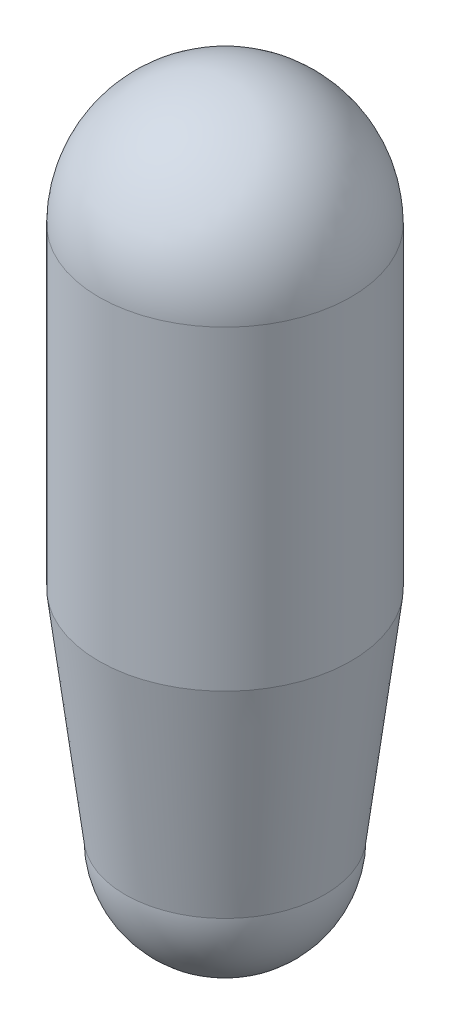
ISO-10303-21;
HEADER;
FILE_DESCRIPTION(('STEP AP214'),'2;1');
FILE_NAME('part.step','',(''),(''),'','','');
FILE_SCHEMA(('AUTOMOTIVE_DESIGN { 1 0 10303 214 1 1 1 1 }'));
ENDSEC;
DATA;
#1=APPLICATION_CONTEXT('core data for automotive mechanical design processes');
#2=APPLICATION_PROTOCOL_DEFINITION('international standard','automotive_design',2000,#1);
#3=PRODUCT_CONTEXT('',#1,'mechanical');
#4=PRODUCT('Part','Part','',(#3));
#5=PRODUCT_RELATED_PRODUCT_CATEGORY('part','',(#4));
#6=PRODUCT_DEFINITION_FORMATION('','',#4);
#7=PRODUCT_DEFINITION_CONTEXT('part definition',#1,'design');
#8=PRODUCT_DEFINITION('design','',#6,#7);
#9=PRODUCT_DEFINITION_SHAPE('','',#8);
#10=(LENGTH_UNIT() NAMED_UNIT(*) SI_UNIT(.MILLI.,.METRE.));
#11=(NAMED_UNIT(*) PLANE_ANGLE_UNIT() SI_UNIT($,.RADIAN.));
#12=(NAMED_UNIT(*) SI_UNIT($,.STERADIAN.) SOLID_ANGLE_UNIT());
#13=UNCERTAINTY_MEASURE_WITH_UNIT(LENGTH_MEASURE(1.E-05),#10,'distance_accuracy_value','');
#14=(GEOMETRIC_REPRESENTATION_CONTEXT(3) GLOBAL_UNCERTAINTY_ASSIGNED_CONTEXT((#13)) GLOBAL_UNIT_ASSIGNED_CONTEXT((#10,
#11,#12)) REPRESENTATION_CONTEXT('',''));
#15=CARTESIAN_POINT('',(0.,0.,0.));
#16=DIRECTION('',(0.,0.,1.));
#17=DIRECTION('',(1.,0.,0.));
#18=AXIS2_PLACEMENT_3D('',#15,#16,#17);
#19=CARTESIAN_POINT('',(0.,0.,0.));
#20=DIRECTION('',(-1.,0.,0.));
#21=DIRECTION('',(0.,1.,0.));
#22=AXIS2_PLACEMENT_3D('',#19,#20,#21);
#23=SPHERICAL_SURFACE('',#22,60.96);
#24=CARTESIAN_POINT('',(0.,0.,0.));
#25=DIRECTION('',(0.,1.,0.));
#26=DIRECTION('',(0.,0.,1.));
#27=AXIS2_PLACEMENT_3D('',#24,#25,#26);
#28=SPHERICAL_SURFACE('',#27,60.96);
#29=CARTESIAN_POINT('',(0.,0.,0.));
#30=DIRECTION('',(0.,1.,0.));
#31=DIRECTION('',(0.,0.,1.));
#32=AXIS2_PLACEMENT_3D('',#29,#30,#31);
#33=CIRCLE('',#32,60.96);
#34=CARTESIAN_POINT('',(0.,0.,60.96));
#35=VERTEX_POINT('',#34);
#36=EDGE_CURVE('E10',#35,#35,#33,.F.);
#37=ORIENTED_EDGE('',*,*,#36,.F.);
#38=EDGE_LOOP('',(#37));
#39=FACE_BOUND('',#38,.T.);
#40=ADVANCED_FACE('F14',(#39),#28,.T.);
#41=CARTESIAN_POINT('',(0.,-256.54,0.));
#42=DIRECTION('',(0.,1.,0.));
#43=DIRECTION('',(0.,0.,1.));
#44=AXIS2_PLACEMENT_3D('',#41,#42,#43);
#45=CONICAL_SURFACE('',#44,48.26,0.121352000570764);
#46=CARTESIAN_POINT('',(0.,-152.4,0.));
#47=DIRECTION('',(0.,1.,0.));
#48=DIRECTION('',(0.,0.,1.));
#49=AXIS2_PLACEMENT_3D('',#46,#47,#48);
#50=CIRCLE('',#49,60.96);
#51=CARTESIAN_POINT('',(0.,-152.4,60.96));
#52=VERTEX_POINT('',#51);
#53=EDGE_CURVE('E20',#52,#52,#50,.T.);
#54=ORIENTED_EDGE('',*,*,#53,.F.);
#55=EDGE_LOOP('',(#54));
#56=FACE_BOUND('',#55,.T.);
#57=CARTESIAN_POINT('',(0.,-256.539999999999,0.));
#58=DIRECTION('',(0.,-1.,0.));
#59=DIRECTION('',(0.,0.,-1.));
#60=AXIS2_PLACEMENT_3D('',#57,#58,#59);
#61=CIRCLE('',#60,48.2600000000001);
#62=CARTESIAN_POINT('',(0.,-256.539999999999,-48.2600000000001));
#63=VERTEX_POINT('',#62);
#64=EDGE_CURVE('E24',#63,#63,#61,.F.);
#65=ORIENTED_EDGE('',*,*,#64,.T.);
#66=EDGE_LOOP('',(#65));
#67=FACE_BOUND('',#66,.T.);
#68=ADVANCED_FACE('F31',(#56,#67),#45,.T.);
#69=CARTESIAN_POINT('',(0.,0.,0.));
#70=DIRECTION('',(0.,1.,0.));
#71=DIRECTION('',(0.,0.,1.));
#72=AXIS2_PLACEMENT_3D('',#69,#70,#71);
#73=CYLINDRICAL_SURFACE('',#72,60.96);
#74=ORIENTED_EDGE('',*,*,#36,.T.);
#75=EDGE_LOOP('',(#74));
#76=FACE_BOUND('',#75,.T.);
#77=ORIENTED_EDGE('',*,*,#53,.T.);
#78=EDGE_LOOP('',(#77));
#79=FACE_BOUND('',#78,.T.);
#80=ADVANCED_FACE('F35',(#76,#79),#73,.T.);
#81=CARTESIAN_POINT('',(0.,-256.54,0.));
#82=DIRECTION('',(-1.,0.,0.));
#83=DIRECTION('',(0.,1.,0.));
#84=AXIS2_PLACEMENT_3D('',#81,#82,#83);
#85=SPHERICAL_SURFACE('',#84,48.26);
#86=CARTESIAN_POINT('',(0.,-256.54,0.));
#87=DIRECTION('',(0.,-1.,0.));
#88=DIRECTION('',(0.,0.,-1.));
#89=AXIS2_PLACEMENT_3D('',#86,#87,#88);
#90=SPHERICAL_SURFACE('',#89,48.26);
#91=ORIENTED_EDGE('',*,*,#64,.F.);
#92=EDGE_LOOP('',(#91));
#93=FACE_BOUND('',#92,.T.);
#94=ADVANCED_FACE('F33',(#93),#90,.T.);
#95=CLOSED_SHELL('',(#40,#68,#80,#94));
#96=MANIFOLD_SOLID_BREP('B1',#95);
#97=ADVANCED_BREP_SHAPE_REPRESENTATION('',(#18,#96),#14);
#98=SHAPE_DEFINITION_REPRESENTATION(#9,#97);
ENDSEC;
END-ISO-10303-21;
